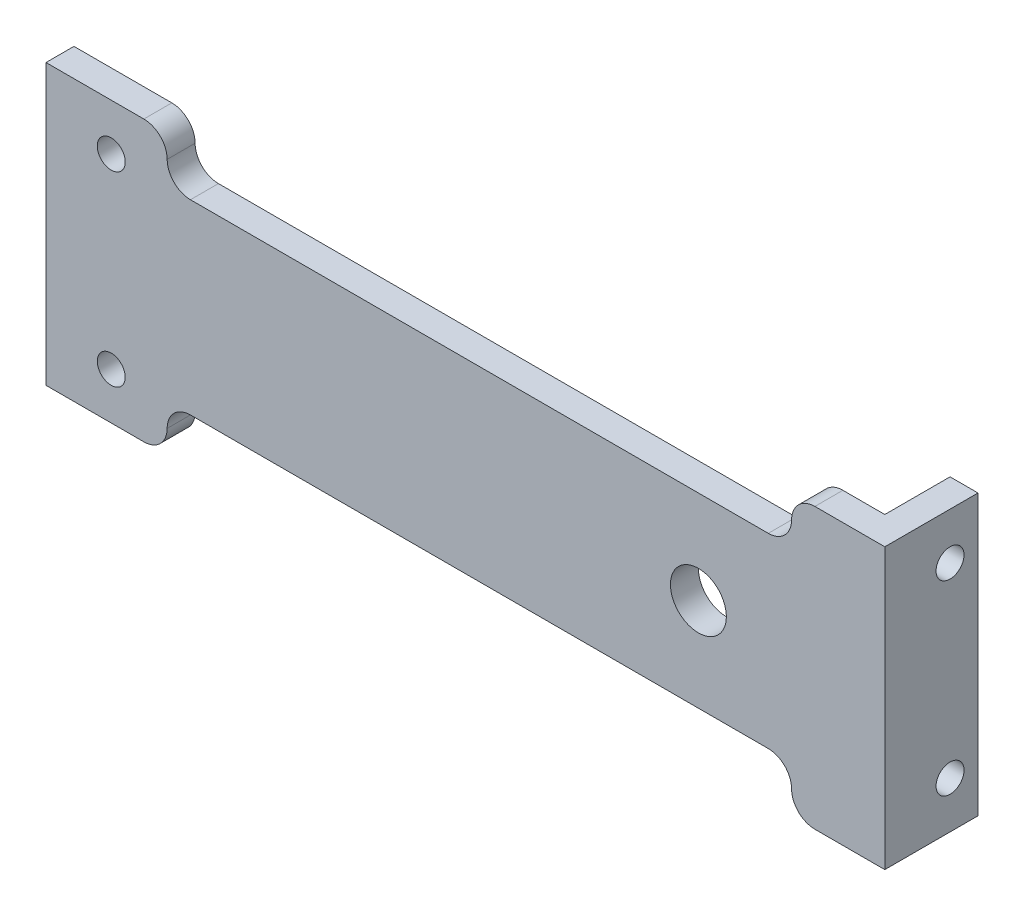
ISO-10303-21;
HEADER;
FILE_DESCRIPTION(('STEP AP214'),'2;1');
FILE_NAME('part.step','',(''),(''),'','','');
FILE_SCHEMA(('AUTOMOTIVE_DESIGN { 1 0 10303 214 1 1 1 1 }'));
ENDSEC;
DATA;
#1=APPLICATION_CONTEXT('core data for automotive mechanical design processes');
#2=APPLICATION_PROTOCOL_DEFINITION('international standard','automotive_design',2000,#1);
#3=PRODUCT_CONTEXT('',#1,'mechanical');
#4=PRODUCT('Part','Part','',(#3));
#5=PRODUCT_RELATED_PRODUCT_CATEGORY('part','',(#4));
#6=PRODUCT_DEFINITION_FORMATION('','',#4);
#7=PRODUCT_DEFINITION_CONTEXT('part definition',#1,'design');
#8=PRODUCT_DEFINITION('design','',#6,#7);
#9=PRODUCT_DEFINITION_SHAPE('','',#8);
#10=(LENGTH_UNIT() NAMED_UNIT(*) SI_UNIT(.MILLI.,.METRE.));
#11=(NAMED_UNIT(*) PLANE_ANGLE_UNIT() SI_UNIT($,.RADIAN.));
#12=(NAMED_UNIT(*) SI_UNIT($,.STERADIAN.) SOLID_ANGLE_UNIT());
#13=UNCERTAINTY_MEASURE_WITH_UNIT(LENGTH_MEASURE(1.E-05),#10,'distance_accuracy_value','');
#14=(GEOMETRIC_REPRESENTATION_CONTEXT(3) GLOBAL_UNCERTAINTY_ASSIGNED_CONTEXT((#13)) GLOBAL_UNIT_ASSIGNED_CONTEXT((#10,
#11,#12)) REPRESENTATION_CONTEXT('',''));
#15=CARTESIAN_POINT('',(0.,0.,0.));
#16=DIRECTION('',(0.,0.,1.));
#17=DIRECTION('',(1.,0.,0.));
#18=AXIS2_PLACEMENT_3D('',#15,#16,#17);
#19=CARTESIAN_POINT('',(0.,0.,0.));
#20=DIRECTION('',(0.,0.,1.));
#21=DIRECTION('',(1.,0.,0.));
#22=AXIS2_PLACEMENT_3D('',#19,#20,#21);
#23=PLANE('',#22);
#24=CARTESIAN_POINT('',(25.,0.,0.));
#25=DIRECTION('',(0.,0.,1.));
#26=DIRECTION('',(1.,0.,0.));
#27=AXIS2_PLACEMENT_3D('',#24,#25,#26);
#28=CIRCLE('',#27,3.);
#29=CARTESIAN_POINT('',(28.,0.,0.));
#30=VERTEX_POINT('',#29);
#31=EDGE_CURVE('E292',#30,#30,#28,.T.);
#32=ORIENTED_EDGE('',*,*,#31,.T.);
#33=EDGE_LOOP('',(#32));
#34=FACE_BOUND('',#33,.T.);
#35=CARTESIAN_POINT('',(-38.,10.,0.));
#36=DIRECTION('',(0.,0.,1.));
#37=DIRECTION('',(1.,0.,0.));
#38=AXIS2_PLACEMENT_3D('',#35,#36,#37);
#39=CIRCLE('',#38,1.5);
#40=CARTESIAN_POINT('',(-36.5,10.,0.));
#41=VERTEX_POINT('',#40);
#42=EDGE_CURVE('E203',#41,#41,#39,.T.);
#43=ORIENTED_EDGE('',*,*,#42,.T.);
#44=EDGE_LOOP('',(#43));
#45=FACE_BOUND('',#44,.T.);
#46=CARTESIAN_POINT('',(-38.,-10.,0.));
#47=DIRECTION('',(0.,0.,-1.));
#48=DIRECTION('',(1.,0.,0.));
#49=AXIS2_PLACEMENT_3D('',#46,#47,#48);
#50=CIRCLE('',#49,1.5);
#51=CARTESIAN_POINT('',(-36.5,-10.,0.));
#52=VERTEX_POINT('',#51);
#53=EDGE_CURVE('E315',#52,#52,#50,.T.);
#54=ORIENTED_EDGE('',*,*,#53,.F.);
#55=EDGE_LOOP('',(#54));
#56=FACE_BOUND('',#55,.T.);
#57=DIRECTION('',(1.,0.,0.));
#58=VECTOR('',#57,1.);
#59=CARTESIAN_POINT('',(-45.,-15.,0.));
#60=LINE('',#59,#58);
#61=CARTESIAN_POINT('',(37.5,-15.,0.));
#62=VERTEX_POINT('',#61);
#63=CARTESIAN_POINT('',(42.,-15.,0.));
#64=VERTEX_POINT('',#63);
#65=EDGE_CURVE('E225',#62,#64,#60,.T.);
#66=ORIENTED_EDGE('',*,*,#65,.F.);
#67=CARTESIAN_POINT('',(37.5,-12.5,0.));
#68=DIRECTION('',(0.,0.,1.));
#69=DIRECTION('',(1.,0.,0.));
#70=AXIS2_PLACEMENT_3D('',#67,#68,#69);
#71=CIRCLE('',#70,2.5);
#72=CARTESIAN_POINT('',(35.,-12.5,0.));
#73=VERTEX_POINT('',#72);
#74=EDGE_CURVE('E252',#62,#73,#71,.F.);
#75=ORIENTED_EDGE('',*,*,#74,.T.);
#76=CARTESIAN_POINT('',(32.5,-12.5,0.));
#77=DIRECTION('',(0.,0.,1.));
#78=DIRECTION('',(1.,0.,0.));
#79=AXIS2_PLACEMENT_3D('',#76,#77,#78);
#80=CIRCLE('',#79,2.5);
#81=CARTESIAN_POINT('',(32.5,-10.,0.));
#82=VERTEX_POINT('',#81);
#83=EDGE_CURVE('E50',#73,#82,#80,.T.);
#84=ORIENTED_EDGE('',*,*,#83,.T.);
#85=DIRECTION('',(1.,0.,0.));
#86=VECTOR('',#85,1.);
#87=CARTESIAN_POINT('',(0.,-10.,0.));
#88=LINE('',#87,#86);
#89=CARTESIAN_POINT('',(-29.5,-10.,0.));
#90=VERTEX_POINT('',#89);
#91=EDGE_CURVE('E306',#90,#82,#88,.T.);
#92=ORIENTED_EDGE('',*,*,#91,.F.);
#93=CARTESIAN_POINT('',(-29.5,-12.5,0.));
#94=DIRECTION('',(0.,0.,1.));
#95=DIRECTION('',(1.,0.,0.));
#96=AXIS2_PLACEMENT_3D('',#93,#94,#95);
#97=CIRCLE('',#96,2.5);
#98=CARTESIAN_POINT('',(-32.,-12.5,0.));
#99=VERTEX_POINT('',#98);
#100=EDGE_CURVE('E58',#90,#99,#97,.T.);
#101=ORIENTED_EDGE('',*,*,#100,.T.);
#102=CARTESIAN_POINT('',(-34.5,-12.5,0.));
#103=DIRECTION('',(0.,0.,1.));
#104=DIRECTION('',(1.,0.,0.));
#105=AXIS2_PLACEMENT_3D('',#102,#103,#104);
#106=CIRCLE('',#105,2.5);
#107=CARTESIAN_POINT('',(-34.5,-15.,0.));
#108=VERTEX_POINT('',#107);
#109=EDGE_CURVE('E250',#99,#108,#106,.F.);
#110=ORIENTED_EDGE('',*,*,#109,.T.);
#111=CARTESIAN_POINT('',(-45.,-15.,0.));
#112=VERTEX_POINT('',#111);
#113=EDGE_CURVE('E211',#112,#108,#60,.T.);
#114=ORIENTED_EDGE('',*,*,#113,.F.);
#115=DIRECTION('',(0.,-1.,0.));
#116=VECTOR('',#115,1.);
#117=CARTESIAN_POINT('',(-45.,15.,0.));
#118=LINE('',#117,#116);
#119=CARTESIAN_POINT('',(-45.,15.,0.));
#120=VERTEX_POINT('',#119);
#121=EDGE_CURVE('E223',#120,#112,#118,.T.);
#122=ORIENTED_EDGE('',*,*,#121,.F.);
#123=DIRECTION('',(-1.,0.,0.));
#124=VECTOR('',#123,1.);
#125=CARTESIAN_POINT('',(-45.,15.,0.));
#126=LINE('',#125,#124);
#127=CARTESIAN_POINT('',(-34.5,15.,0.));
#128=VERTEX_POINT('',#127);
#129=EDGE_CURVE('E206',#128,#120,#126,.T.);
#130=ORIENTED_EDGE('',*,*,#129,.F.);
#131=CARTESIAN_POINT('',(-34.5,12.5,0.));
#132=DIRECTION('',(0.,0.,1.));
#133=DIRECTION('',(1.,0.,0.));
#134=AXIS2_PLACEMENT_3D('',#131,#132,#133);
#135=CIRCLE('',#134,2.5);
#136=CARTESIAN_POINT('',(-32.,12.5,0.));
#137=VERTEX_POINT('',#136);
#138=EDGE_CURVE('E246',#128,#137,#135,.F.);
#139=ORIENTED_EDGE('',*,*,#138,.T.);
#140=CARTESIAN_POINT('',(-29.5,12.5,0.));
#141=DIRECTION('',(0.,0.,1.));
#142=DIRECTION('',(1.,0.,0.));
#143=AXIS2_PLACEMENT_3D('',#140,#141,#142);
#144=CIRCLE('',#143,2.5);
#145=CARTESIAN_POINT('',(-29.5,10.,0.));
#146=VERTEX_POINT('',#145);
#147=EDGE_CURVE('E11',#137,#146,#144,.T.);
#148=ORIENTED_EDGE('',*,*,#147,.T.);
#149=DIRECTION('',(1.,0.,0.));
#150=VECTOR('',#149,1.);
#151=CARTESIAN_POINT('',(0.,10.,0.));
#152=LINE('',#151,#150);
#153=CARTESIAN_POINT('',(32.5,10.,0.));
#154=VERTEX_POINT('',#153);
#155=EDGE_CURVE('E323',#146,#154,#152,.T.);
#156=ORIENTED_EDGE('',*,*,#155,.T.);
#157=CARTESIAN_POINT('',(32.5,12.5,0.));
#158=DIRECTION('',(0.,0.,1.));
#159=DIRECTION('',(1.,0.,0.));
#160=AXIS2_PLACEMENT_3D('',#157,#158,#159);
#161=CIRCLE('',#160,2.5);
#162=CARTESIAN_POINT('',(35.,12.5,0.));
#163=VERTEX_POINT('',#162);
#164=EDGE_CURVE('E278',#154,#163,#161,.T.);
#165=ORIENTED_EDGE('',*,*,#164,.T.);
#166=CARTESIAN_POINT('',(37.5,12.5,0.));
#167=DIRECTION('',(0.,0.,1.));
#168=DIRECTION('',(1.,0.,0.));
#169=AXIS2_PLACEMENT_3D('',#166,#167,#168);
#170=CIRCLE('',#169,2.5);
#171=CARTESIAN_POINT('',(37.5,15.,0.));
#172=VERTEX_POINT('',#171);
#173=EDGE_CURVE('E248',#163,#172,#170,.F.);
#174=ORIENTED_EDGE('',*,*,#173,.T.);
#175=CARTESIAN_POINT('',(42.,15.,0.));
#176=VERTEX_POINT('',#175);
#177=EDGE_CURVE('E220',#176,#172,#126,.T.);
#178=ORIENTED_EDGE('',*,*,#177,.F.);
#179=DIRECTION('',(0.,1.,0.));
#180=VECTOR('',#179,1.);
#181=CARTESIAN_POINT('',(42.,15.,0.));
#182=LINE('',#181,#180);
#183=EDGE_CURVE('E188',#64,#176,#182,.T.);
#184=ORIENTED_EDGE('',*,*,#183,.F.);
#185=EDGE_LOOP('',(#66,#75,#84,#92,#101,#110,#114,#122,#130,#139,#148,#156,#165,#174,#178,#184));
#186=FACE_BOUND('',#185,.T.);
#187=ADVANCED_FACE('F33',(#34,#45,#56,#186),#23,.F.);
#188=CARTESIAN_POINT('',(-45.,-15.,3.));
#189=DIRECTION('',(0.,1.,0.));
#190=DIRECTION('',(0.,0.,1.));
#191=AXIS2_PLACEMENT_3D('',#188,#189,#190);
#192=PLANE('',#191);
#193=ORIENTED_EDGE('',*,*,#113,.T.);
#194=DIRECTION('',(0.,0.,1.));
#195=VECTOR('',#194,1.);
#196=CARTESIAN_POINT('',(-34.5,-15.,3.));
#197=LINE('',#196,#195);
#198=CARTESIAN_POINT('',(-34.5,-15.,3.));
#199=VERTEX_POINT('',#198);
#200=EDGE_CURVE('E258',#108,#199,#197,.T.);
#201=ORIENTED_EDGE('',*,*,#200,.T.);
#202=DIRECTION('',(1.,0.,0.));
#203=VECTOR('',#202,1.);
#204=CARTESIAN_POINT('',(-45.,-15.,3.));
#205=LINE('',#204,#203);
#206=CARTESIAN_POINT('',(-45.,-15.,3.));
#207=VERTEX_POINT('',#206);
#208=EDGE_CURVE('E173',#207,#199,#205,.T.);
#209=ORIENTED_EDGE('',*,*,#208,.F.);
#210=DIRECTION('',(0.,0.,-1.));
#211=VECTOR('',#210,1.);
#212=CARTESIAN_POINT('',(-45.,-15.,3.));
#213=LINE('',#212,#211);
#214=EDGE_CURVE('E172',#207,#112,#213,.T.);
#215=ORIENTED_EDGE('',*,*,#214,.T.);
#216=EDGE_LOOP('',(#193,#201,#209,#215));
#217=FACE_BOUND('',#216,.T.);
#218=ADVANCED_FACE('F347',(#217),#192,.F.);
#219=CARTESIAN_POINT('',(37.5,-15.,3.));
#220=VERTEX_POINT('',#219);
#221=CARTESIAN_POINT('',(45.,-15.,3.));
#222=VERTEX_POINT('',#221);
#223=EDGE_CURVE('E217',#220,#222,#205,.T.);
#224=ORIENTED_EDGE('',*,*,#223,.F.);
#225=DIRECTION('',(0.,0.,1.));
#226=VECTOR('',#225,1.);
#227=CARTESIAN_POINT('',(37.5,-15.,0.));
#228=LINE('',#227,#226);
#229=EDGE_CURVE('E243',#220,#62,#228,.F.);
#230=ORIENTED_EDGE('',*,*,#229,.T.);
#231=ORIENTED_EDGE('',*,*,#65,.T.);
#232=DIRECTION('',(0.,0.,1.));
#233=VECTOR('',#232,1.);
#234=CARTESIAN_POINT('',(42.,-15.,-7.));
#235=LINE('',#234,#233);
#236=CARTESIAN_POINT('',(42.,-15.,-7.));
#237=VERTEX_POINT('',#236);
#238=EDGE_CURVE('E179',#237,#64,#235,.T.);
#239=ORIENTED_EDGE('',*,*,#238,.F.);
#240=DIRECTION('',(-1.,0.,0.));
#241=VECTOR('',#240,1.);
#242=CARTESIAN_POINT('',(45.,-15.,-7.));
#243=LINE('',#242,#241);
#244=CARTESIAN_POINT('',(45.,-15.,-7.));
#245=VERTEX_POINT('',#244);
#246=EDGE_CURVE('E176',#245,#237,#243,.T.);
#247=ORIENTED_EDGE('',*,*,#246,.F.);
#248=DIRECTION('',(0.,0.,-1.));
#249=VECTOR('',#248,1.);
#250=CARTESIAN_POINT('',(45.,-15.,3.));
#251=LINE('',#250,#249);
#252=EDGE_CURVE('E162',#222,#245,#251,.T.);
#253=ORIENTED_EDGE('',*,*,#252,.F.);
#254=EDGE_LOOP('',(#224,#230,#231,#239,#247,#253));
#255=FACE_BOUND('',#254,.T.);
#256=ADVANCED_FACE('F177',(#255),#192,.F.);
#257=CARTESIAN_POINT('',(0.,0.,3.));
#258=DIRECTION('',(0.,0.,1.));
#259=DIRECTION('',(1.,0.,0.));
#260=AXIS2_PLACEMENT_3D('',#257,#258,#259);
#261=PLANE('',#260);
#262=CARTESIAN_POINT('',(25.,0.,3.));
#263=DIRECTION('',(0.,0.,1.));
#264=DIRECTION('',(1.,0.,0.));
#265=AXIS2_PLACEMENT_3D('',#262,#263,#264);
#266=CIRCLE('',#265,3.);
#267=CARTESIAN_POINT('',(28.,0.,3.));
#268=VERTEX_POINT('',#267);
#269=EDGE_CURVE('E297',#268,#268,#266,.T.);
#270=ORIENTED_EDGE('',*,*,#269,.F.);
#271=EDGE_LOOP('',(#270));
#272=FACE_BOUND('',#271,.T.);
#273=CARTESIAN_POINT('',(-38.,-10.,3.));
#274=DIRECTION('',(0.,0.,-1.));
#275=DIRECTION('',(1.,0.,0.));
#276=AXIS2_PLACEMENT_3D('',#273,#274,#275);
#277=CIRCLE('',#276,1.5);
#278=CARTESIAN_POINT('',(-36.5,-10.,3.));
#279=VERTEX_POINT('',#278);
#280=EDGE_CURVE('E314',#279,#279,#277,.T.);
#281=ORIENTED_EDGE('',*,*,#280,.T.);
#282=EDGE_LOOP('',(#281));
#283=FACE_BOUND('',#282,.T.);
#284=CARTESIAN_POINT('',(-38.,10.,3.));
#285=DIRECTION('',(0.,0.,1.));
#286=DIRECTION('',(1.,0.,0.));
#287=AXIS2_PLACEMENT_3D('',#284,#285,#286);
#288=CIRCLE('',#287,1.5);
#289=CARTESIAN_POINT('',(-36.5,10.,3.));
#290=VERTEX_POINT('',#289);
#291=EDGE_CURVE('E202',#290,#290,#288,.T.);
#292=ORIENTED_EDGE('',*,*,#291,.F.);
#293=EDGE_LOOP('',(#292));
#294=FACE_BOUND('',#293,.T.);
#295=DIRECTION('',(1.,0.,0.));
#296=VECTOR('',#295,1.);
#297=CARTESIAN_POINT('',(-32.,-10.,3.));
#298=LINE('',#297,#296);
#299=CARTESIAN_POINT('',(-29.5,-10.,3.));
#300=VERTEX_POINT('',#299);
#301=CARTESIAN_POINT('',(32.5,-10.,3.));
#302=VERTEX_POINT('',#301);
#303=EDGE_CURVE('E284',#300,#302,#298,.T.);
#304=ORIENTED_EDGE('',*,*,#303,.T.);
#305=CARTESIAN_POINT('',(32.5,-12.5,3.));
#306=DIRECTION('',(0.,0.,1.));
#307=DIRECTION('',(1.,0.,0.));
#308=AXIS2_PLACEMENT_3D('',#305,#306,#307);
#309=CIRCLE('',#308,2.5);
#310=CARTESIAN_POINT('',(35.,-12.5,3.));
#311=VERTEX_POINT('',#310);
#312=EDGE_CURVE('E270',#302,#311,#309,.F.);
#313=ORIENTED_EDGE('',*,*,#312,.T.);
#314=CARTESIAN_POINT('',(37.5,-12.5,3.));
#315=DIRECTION('',(0.,0.,1.));
#316=DIRECTION('',(1.,0.,0.));
#317=AXIS2_PLACEMENT_3D('',#314,#315,#316);
#318=CIRCLE('',#317,2.5);
#319=EDGE_CURVE('E241',#311,#220,#318,.T.);
#320=ORIENTED_EDGE('',*,*,#319,.T.);
#321=ORIENTED_EDGE('',*,*,#223,.T.);
#322=DIRECTION('',(0.,1.,0.));
#323=VECTOR('',#322,1.);
#324=CARTESIAN_POINT('',(45.,15.,3.));
#325=LINE('',#324,#323);
#326=CARTESIAN_POINT('',(45.,15.,3.));
#327=VERTEX_POINT('',#326);
#328=EDGE_CURVE('E169',#222,#327,#325,.T.);
#329=ORIENTED_EDGE('',*,*,#328,.T.);
#330=DIRECTION('',(-1.,0.,0.));
#331=VECTOR('',#330,1.);
#332=CARTESIAN_POINT('',(-45.,15.,3.));
#333=LINE('',#332,#331);
#334=CARTESIAN_POINT('',(37.5,15.,3.));
#335=VERTEX_POINT('',#334);
#336=EDGE_CURVE('E212',#327,#335,#333,.T.);
#337=ORIENTED_EDGE('',*,*,#336,.T.);
#338=CARTESIAN_POINT('',(37.5,12.5,3.));
#339=DIRECTION('',(0.,0.,1.));
#340=DIRECTION('',(1.,0.,0.));
#341=AXIS2_PLACEMENT_3D('',#338,#339,#340);
#342=CIRCLE('',#341,2.5);
#343=CARTESIAN_POINT('',(35.,12.5,3.));
#344=VERTEX_POINT('',#343);
#345=EDGE_CURVE('E237',#335,#344,#342,.T.);
#346=ORIENTED_EDGE('',*,*,#345,.T.);
#347=CARTESIAN_POINT('',(32.5,12.5,3.));
#348=DIRECTION('',(0.,0.,1.));
#349=DIRECTION('',(1.,0.,0.));
#350=AXIS2_PLACEMENT_3D('',#347,#348,#349);
#351=CIRCLE('',#350,2.5);
#352=CARTESIAN_POINT('',(32.5,10.,3.));
#353=VERTEX_POINT('',#352);
#354=EDGE_CURVE('E276',#344,#353,#351,.F.);
#355=ORIENTED_EDGE('',*,*,#354,.T.);
#356=DIRECTION('',(1.,0.,0.));
#357=VECTOR('',#356,1.);
#358=CARTESIAN_POINT('',(-32.,10.,3.));
#359=LINE('',#358,#357);
#360=CARTESIAN_POINT('',(-29.5,10.,3.));
#361=VERTEX_POINT('',#360);
#362=EDGE_CURVE('E318',#361,#353,#359,.T.);
#363=ORIENTED_EDGE('',*,*,#362,.F.);
#364=CARTESIAN_POINT('',(-29.5,12.5,3.));
#365=DIRECTION('',(0.,0.,1.));
#366=DIRECTION('',(1.,0.,0.));
#367=AXIS2_PLACEMENT_3D('',#364,#365,#366);
#368=CIRCLE('',#367,2.5);
#369=CARTESIAN_POINT('',(-32.,12.5,3.));
#370=VERTEX_POINT('',#369);
#371=EDGE_CURVE('E42',#361,#370,#368,.F.);
#372=ORIENTED_EDGE('',*,*,#371,.T.);
#373=CARTESIAN_POINT('',(-34.5,12.5,3.));
#374=DIRECTION('',(0.,0.,1.));
#375=DIRECTION('',(1.,0.,0.));
#376=AXIS2_PLACEMENT_3D('',#373,#374,#375);
#377=CIRCLE('',#376,2.5);
#378=CARTESIAN_POINT('',(-34.5,15.,3.));
#379=VERTEX_POINT('',#378);
#380=EDGE_CURVE('E235',#370,#379,#377,.T.);
#381=ORIENTED_EDGE('',*,*,#380,.T.);
#382=CARTESIAN_POINT('',(-45.,15.,3.));
#383=VERTEX_POINT('',#382);
#384=EDGE_CURVE('E210',#379,#383,#333,.T.);
#385=ORIENTED_EDGE('',*,*,#384,.T.);
#386=DIRECTION('',(0.,-1.,0.));
#387=VECTOR('',#386,1.);
#388=CARTESIAN_POINT('',(-45.,15.,3.));
#389=LINE('',#388,#387);
#390=EDGE_CURVE('E215',#383,#207,#389,.T.);
#391=ORIENTED_EDGE('',*,*,#390,.T.);
#392=ORIENTED_EDGE('',*,*,#208,.T.);
#393=CARTESIAN_POINT('',(-34.5,-12.5,3.));
#394=DIRECTION('',(0.,0.,1.));
#395=DIRECTION('',(1.,0.,0.));
#396=AXIS2_PLACEMENT_3D('',#393,#394,#395);
#397=CIRCLE('',#396,2.5);
#398=CARTESIAN_POINT('',(-32.,-12.5,3.));
#399=VERTEX_POINT('',#398);
#400=EDGE_CURVE('E239',#199,#399,#397,.T.);
#401=ORIENTED_EDGE('',*,*,#400,.T.);
#402=CARTESIAN_POINT('',(-29.5,-12.5,3.));
#403=DIRECTION('',(0.,0.,1.));
#404=DIRECTION('',(1.,0.,0.));
#405=AXIS2_PLACEMENT_3D('',#402,#403,#404);
#406=CIRCLE('',#405,2.5);
#407=EDGE_CURVE('E273',#399,#300,#406,.F.);
#408=ORIENTED_EDGE('',*,*,#407,.T.);
#409=EDGE_LOOP('',(#304,#313,#320,#321,#329,#337,#346,#355,#363,#372,#381,#385,#391,#392,#401,#408));
#410=FACE_BOUND('',#409,.T.);
#411=ADVANCED_FACE('F356',(#272,#283,#294,#410),#261,.T.);
#412=CARTESIAN_POINT('',(-45.,15.,3.));
#413=DIRECTION('',(0.,-1.,0.));
#414=DIRECTION('',(0.,0.,-1.));
#415=AXIS2_PLACEMENT_3D('',#412,#413,#414);
#416=PLANE('',#415);
#417=ORIENTED_EDGE('',*,*,#384,.F.);
#418=DIRECTION('',(0.,0.,1.));
#419=VECTOR('',#418,1.);
#420=CARTESIAN_POINT('',(-34.5,15.,3.));
#421=LINE('',#420,#419);
#422=EDGE_CURVE('E268',#379,#128,#421,.F.);
#423=ORIENTED_EDGE('',*,*,#422,.T.);
#424=ORIENTED_EDGE('',*,*,#129,.T.);
#425=DIRECTION('',(0.,0.,-1.));
#426=VECTOR('',#425,1.);
#427=CARTESIAN_POINT('',(-45.,15.,3.));
#428=LINE('',#427,#426);
#429=EDGE_CURVE('E230',#383,#120,#428,.T.);
#430=ORIENTED_EDGE('',*,*,#429,.F.);
#431=EDGE_LOOP('',(#417,#423,#424,#430));
#432=FACE_BOUND('',#431,.T.);
#433=ADVANCED_FACE('F368',(#432),#416,.F.);
#434=CARTESIAN_POINT('',(45.,15.,3.));
#435=DIRECTION('',(-1.,0.,0.));
#436=DIRECTION('',(0.,0.,1.));
#437=AXIS2_PLACEMENT_3D('',#434,#435,#436);
#438=PLANE('',#437);
#439=CARTESIAN_POINT('',(45.,-9.99999999999999,-4.));
#440=DIRECTION('',(-1.,0.,0.));
#441=DIRECTION('',(0.,0.,1.));
#442=AXIS2_PLACEMENT_3D('',#439,#440,#441);
#443=CIRCLE('',#442,1.5);
#444=CARTESIAN_POINT('',(45.,-9.99999999999999,-2.5));
#445=VERTEX_POINT('',#444);
#446=EDGE_CURVE('E311',#445,#445,#443,.F.);
#447=ORIENTED_EDGE('',*,*,#446,.F.);
#448=EDGE_LOOP('',(#447));
#449=FACE_BOUND('',#448,.T.);
#450=CARTESIAN_POINT('',(45.,9.99999999999999,-4.));
#451=DIRECTION('',(-1.,0.,0.));
#452=DIRECTION('',(0.,0.,1.));
#453=AXIS2_PLACEMENT_3D('',#450,#451,#452);
#454=CIRCLE('',#453,1.5);
#455=CARTESIAN_POINT('',(45.,9.99999999999999,-2.5));
#456=VERTEX_POINT('',#455);
#457=EDGE_CURVE('E191',#456,#456,#454,.T.);
#458=ORIENTED_EDGE('',*,*,#457,.T.);
#459=EDGE_LOOP('',(#458));
#460=FACE_BOUND('',#459,.T.);
#461=ORIENTED_EDGE('',*,*,#252,.T.);
#462=DIRECTION('',(0.,-1.,0.));
#463=VECTOR('',#462,1.);
#464=CARTESIAN_POINT('',(45.,15.,-7.));
#465=LINE('',#464,#463);
#466=CARTESIAN_POINT('',(45.,15.,-7.));
#467=VERTEX_POINT('',#466);
#468=EDGE_CURVE('E167',#467,#245,#465,.T.);
#469=ORIENTED_EDGE('',*,*,#468,.F.);
#470=DIRECTION('',(0.,0.,-1.));
#471=VECTOR('',#470,1.);
#472=CARTESIAN_POINT('',(45.,15.,3.));
#473=LINE('',#472,#471);
#474=EDGE_CURVE('E233',#327,#467,#473,.T.);
#475=ORIENTED_EDGE('',*,*,#474,.F.);
#476=ORIENTED_EDGE('',*,*,#328,.F.);
#477=EDGE_LOOP('',(#461,#469,#475,#476));
#478=FACE_BOUND('',#477,.T.);
#479=ADVANCED_FACE('F164',(#449,#460,#478),#438,.F.);
#480=ORIENTED_EDGE('',*,*,#177,.T.);
#481=DIRECTION('',(0.,0.,1.));
#482=VECTOR('',#481,1.);
#483=CARTESIAN_POINT('',(37.5,15.,3.));
#484=LINE('',#483,#482);
#485=EDGE_CURVE('E266',#172,#335,#484,.T.);
#486=ORIENTED_EDGE('',*,*,#485,.T.);
#487=ORIENTED_EDGE('',*,*,#336,.F.);
#488=ORIENTED_EDGE('',*,*,#474,.T.);
#489=DIRECTION('',(1.,0.,0.));
#490=VECTOR('',#489,1.);
#491=CARTESIAN_POINT('',(45.,15.,-7.));
#492=LINE('',#491,#490);
#493=CARTESIAN_POINT('',(42.,15.,-7.));
#494=VERTEX_POINT('',#493);
#495=EDGE_CURVE('E187',#494,#467,#492,.T.);
#496=ORIENTED_EDGE('',*,*,#495,.F.);
#497=DIRECTION('',(0.,0.,1.));
#498=VECTOR('',#497,1.);
#499=CARTESIAN_POINT('',(42.,15.,-7.));
#500=LINE('',#499,#498);
#501=EDGE_CURVE('E197',#494,#176,#500,.T.);
#502=ORIENTED_EDGE('',*,*,#501,.T.);
#503=EDGE_LOOP('',(#480,#486,#487,#488,#496,#502));
#504=FACE_BOUND('',#503,.T.);
#505=ADVANCED_FACE('F363',(#504),#416,.F.);
#506=CARTESIAN_POINT('',(-45.,15.,3.));
#507=DIRECTION('',(1.,0.,0.));
#508=DIRECTION('',(0.,1.,0.));
#509=AXIS2_PLACEMENT_3D('',#506,#507,#508);
#510=PLANE('',#509);
#511=ORIENTED_EDGE('',*,*,#121,.T.);
#512=ORIENTED_EDGE('',*,*,#214,.F.);
#513=ORIENTED_EDGE('',*,*,#390,.F.);
#514=ORIENTED_EDGE('',*,*,#429,.T.);
#515=EDGE_LOOP('',(#511,#512,#513,#514));
#516=FACE_BOUND('',#515,.T.);
#517=ADVANCED_FACE('F359',(#516),#510,.F.);
#518=CARTESIAN_POINT('',(-38.,10.,0.));
#519=DIRECTION('',(0.,0.,1.));
#520=DIRECTION('',(1.,0.,0.));
#521=AXIS2_PLACEMENT_3D('',#518,#519,#520);
#522=CYLINDRICAL_SURFACE('',#521,1.5);
#523=ORIENTED_EDGE('',*,*,#42,.F.);
#524=EDGE_LOOP('',(#523));
#525=FACE_BOUND('',#524,.T.);
#526=ORIENTED_EDGE('',*,*,#291,.T.);
#527=EDGE_LOOP('',(#526));
#528=FACE_BOUND('',#527,.T.);
#529=ADVANCED_FACE('F362',(#525,#528),#522,.F.);
#530=CARTESIAN_POINT('',(42.,15.,-7.));
#531=DIRECTION('',(1.,0.,0.));
#532=DIRECTION('',(0.,0.,-1.));
#533=AXIS2_PLACEMENT_3D('',#530,#531,#532);
#534=PLANE('',#533);
#535=CARTESIAN_POINT('',(42.,-9.99999999999999,-4.));
#536=DIRECTION('',(1.,0.,0.));
#537=DIRECTION('',(0.,0.,1.));
#538=AXIS2_PLACEMENT_3D('',#535,#536,#537);
#539=CIRCLE('',#538,1.5);
#540=CARTESIAN_POINT('',(42.,-9.99999999999999,-2.5));
#541=VERTEX_POINT('',#540);
#542=EDGE_CURVE('E308',#541,#541,#539,.T.);
#543=ORIENTED_EDGE('',*,*,#542,.T.);
#544=EDGE_LOOP('',(#543));
#545=FACE_BOUND('',#544,.T.);
#546=CARTESIAN_POINT('',(42.,9.99999999999999,-4.));
#547=DIRECTION('',(-1.,0.,0.));
#548=DIRECTION('',(0.,0.,1.));
#549=AXIS2_PLACEMENT_3D('',#546,#547,#548);
#550=CIRCLE('',#549,1.5);
#551=CARTESIAN_POINT('',(42.,9.99999999999999,-2.5));
#552=VERTEX_POINT('',#551);
#553=EDGE_CURVE('E325',#552,#552,#550,.T.);
#554=ORIENTED_EDGE('',*,*,#553,.F.);
#555=EDGE_LOOP('',(#554));
#556=FACE_BOUND('',#555,.T.);
#557=ORIENTED_EDGE('',*,*,#183,.T.);
#558=ORIENTED_EDGE('',*,*,#501,.F.);
#559=DIRECTION('',(0.,1.,0.));
#560=VECTOR('',#559,1.);
#561=CARTESIAN_POINT('',(42.,15.,-7.));
#562=LINE('',#561,#560);
#563=EDGE_CURVE('E182',#237,#494,#562,.T.);
#564=ORIENTED_EDGE('',*,*,#563,.F.);
#565=ORIENTED_EDGE('',*,*,#238,.T.);
#566=EDGE_LOOP('',(#557,#558,#564,#565));
#567=FACE_BOUND('',#566,.T.);
#568=ADVANCED_FACE('F344',(#545,#556,#567),#534,.F.);
#569=CARTESIAN_POINT('',(0.,0.,-7.));
#570=DIRECTION('',(0.,0.,-1.));
#571=DIRECTION('',(-1.,0.,0.));
#572=AXIS2_PLACEMENT_3D('',#569,#570,#571);
#573=PLANE('',#572);
#574=ORIENTED_EDGE('',*,*,#468,.T.);
#575=ORIENTED_EDGE('',*,*,#246,.T.);
#576=ORIENTED_EDGE('',*,*,#563,.T.);
#577=ORIENTED_EDGE('',*,*,#495,.T.);
#578=EDGE_LOOP('',(#574,#575,#576,#577));
#579=FACE_BOUND('',#578,.T.);
#580=ADVANCED_FACE('F185',(#579),#573,.T.);
#581=CARTESIAN_POINT('',(49.,9.99999999999999,-4.));
#582=DIRECTION('',(-1.,0.,0.));
#583=DIRECTION('',(0.,0.,1.));
#584=AXIS2_PLACEMENT_3D('',#581,#582,#583);
#585=CYLINDRICAL_SURFACE('',#584,1.5);
#586=ORIENTED_EDGE('',*,*,#553,.T.);
#587=EDGE_LOOP('',(#586));
#588=FACE_BOUND('',#587,.T.);
#589=ORIENTED_EDGE('',*,*,#457,.F.);
#590=EDGE_LOOP('',(#589));
#591=FACE_BOUND('',#590,.T.);
#592=ADVANCED_FACE('F333',(#588,#591),#585,.F.);
#593=CARTESIAN_POINT('',(-32.,10.,-4.));
#594=DIRECTION('',(0.,-1.,0.));
#595=DIRECTION('',(0.,0.,-1.));
#596=AXIS2_PLACEMENT_3D('',#593,#594,#595);
#597=PLANE('',#596);
#598=ORIENTED_EDGE('',*,*,#362,.T.);
#599=DIRECTION('',(0.,0.,1.));
#600=VECTOR('',#599,1.);
#601=CARTESIAN_POINT('',(32.5,10.,0.));
#602=LINE('',#601,#600);
#603=EDGE_CURVE('E263',#353,#154,#602,.F.);
#604=ORIENTED_EDGE('',*,*,#603,.T.);
#605=ORIENTED_EDGE('',*,*,#155,.F.);
#606=DIRECTION('',(0.,0.,1.));
#607=VECTOR('',#606,1.);
#608=CARTESIAN_POINT('',(-29.5,10.,3.));
#609=LINE('',#608,#607);
#610=EDGE_CURVE('E260',#146,#361,#609,.T.);
#611=ORIENTED_EDGE('',*,*,#610,.T.);
#612=EDGE_LOOP('',(#598,#604,#605,#611));
#613=FACE_BOUND('',#612,.T.);
#614=ADVANCED_FACE('F335',(#613),#597,.F.);
#615=CARTESIAN_POINT('',(-38.,-10.,0.));
#616=DIRECTION('',(0.,0.,1.));
#617=DIRECTION('',(1.,0.,0.));
#618=AXIS2_PLACEMENT_3D('',#615,#616,#617);
#619=CYLINDRICAL_SURFACE('',#618,1.5);
#620=ORIENTED_EDGE('',*,*,#53,.T.);
#621=EDGE_LOOP('',(#620));
#622=FACE_BOUND('',#621,.T.);
#623=ORIENTED_EDGE('',*,*,#280,.F.);
#624=EDGE_LOOP('',(#623));
#625=FACE_BOUND('',#624,.T.);
#626=ADVANCED_FACE('F341',(#622,#625),#619,.F.);
#627=CARTESIAN_POINT('',(49.,-9.99999999999999,-4.));
#628=DIRECTION('',(-1.,0.,0.));
#629=DIRECTION('',(0.,0.,1.));
#630=AXIS2_PLACEMENT_3D('',#627,#628,#629);
#631=CYLINDRICAL_SURFACE('',#630,1.5);
#632=ORIENTED_EDGE('',*,*,#542,.F.);
#633=EDGE_LOOP('',(#632));
#634=FACE_BOUND('',#633,.T.);
#635=ORIENTED_EDGE('',*,*,#446,.T.);
#636=EDGE_LOOP('',(#635));
#637=FACE_BOUND('',#636,.T.);
#638=ADVANCED_FACE('F467',(#634,#637),#631,.F.);
#639=CARTESIAN_POINT('',(-32.,-10.,-4.));
#640=DIRECTION('',(0.,-1.,0.));
#641=DIRECTION('',(0.,0.,-1.));
#642=AXIS2_PLACEMENT_3D('',#639,#640,#641);
#643=PLANE('',#642);
#644=ORIENTED_EDGE('',*,*,#91,.T.);
#645=DIRECTION('',(0.,0.,1.));
#646=VECTOR('',#645,1.);
#647=CARTESIAN_POINT('',(32.5,-10.,3.));
#648=LINE('',#647,#646);
#649=EDGE_CURVE('E256',#82,#302,#648,.T.);
#650=ORIENTED_EDGE('',*,*,#649,.T.);
#651=ORIENTED_EDGE('',*,*,#303,.F.);
#652=DIRECTION('',(0.,0.,1.));
#653=VECTOR('',#652,1.);
#654=CARTESIAN_POINT('',(-29.5,-10.,0.));
#655=LINE('',#654,#653);
#656=EDGE_CURVE('E254',#300,#90,#655,.F.);
#657=ORIENTED_EDGE('',*,*,#656,.T.);
#658=EDGE_LOOP('',(#644,#650,#651,#657));
#659=FACE_BOUND('',#658,.T.);
#660=ADVANCED_FACE('F380',(#659),#643,.T.);
#661=CARTESIAN_POINT('',(32.5,-12.5,-4.));
#662=DIRECTION('',(0.,0.,-1.));
#663=DIRECTION('',(-1.,0.,0.));
#664=AXIS2_PLACEMENT_3D('',#661,#662,#663);
#665=CYLINDRICAL_SURFACE('',#664,2.5);
#666=ORIENTED_EDGE('',*,*,#649,.F.);
#667=ORIENTED_EDGE('',*,*,#83,.F.);
#668=DIRECTION('',(0.,0.,1.));
#669=VECTOR('',#668,1.);
#670=CARTESIAN_POINT('',(35.,-12.5,0.));
#671=LINE('',#670,#669);
#672=EDGE_CURVE('E281',#311,#73,#671,.F.);
#673=ORIENTED_EDGE('',*,*,#672,.F.);
#674=ORIENTED_EDGE('',*,*,#312,.F.);
#675=EDGE_LOOP('',(#666,#667,#673,#674));
#676=FACE_BOUND('',#675,.T.);
#677=ADVANCED_FACE('F376',(#676),#665,.F.);
#678=CARTESIAN_POINT('',(37.5,-12.5,-4.));
#679=DIRECTION('',(0.,0.,-1.));
#680=DIRECTION('',(-1.,0.,0.));
#681=AXIS2_PLACEMENT_3D('',#678,#679,#680);
#682=CYLINDRICAL_SURFACE('',#681,2.5);
#683=ORIENTED_EDGE('',*,*,#74,.F.);
#684=ORIENTED_EDGE('',*,*,#229,.F.);
#685=ORIENTED_EDGE('',*,*,#319,.F.);
#686=ORIENTED_EDGE('',*,*,#672,.T.);
#687=EDGE_LOOP('',(#683,#684,#685,#686));
#688=FACE_BOUND('',#687,.T.);
#689=ADVANCED_FACE('F372',(#688),#682,.T.);
#690=CARTESIAN_POINT('',(-34.5,-12.5,3.));
#691=DIRECTION('',(0.,0.,-1.));
#692=DIRECTION('',(-1.,0.,0.));
#693=AXIS2_PLACEMENT_3D('',#690,#691,#692);
#694=CYLINDRICAL_SURFACE('',#693,2.5);
#695=ORIENTED_EDGE('',*,*,#200,.F.);
#696=ORIENTED_EDGE('',*,*,#109,.F.);
#697=DIRECTION('',(0.,0.,1.));
#698=VECTOR('',#697,1.);
#699=CARTESIAN_POINT('',(-32.,-12.5,0.));
#700=LINE('',#699,#698);
#701=EDGE_CURVE('E285',#399,#99,#700,.F.);
#702=ORIENTED_EDGE('',*,*,#701,.F.);
#703=ORIENTED_EDGE('',*,*,#400,.F.);
#704=EDGE_LOOP('',(#695,#696,#702,#703));
#705=FACE_BOUND('',#704,.T.);
#706=ADVANCED_FACE('F375',(#705),#694,.T.);
#707=CARTESIAN_POINT('',(-29.5,-12.5,-4.));
#708=DIRECTION('',(0.,0.,-1.));
#709=DIRECTION('',(-1.,0.,0.));
#710=AXIS2_PLACEMENT_3D('',#707,#708,#709);
#711=CYLINDRICAL_SURFACE('',#710,2.5);
#712=ORIENTED_EDGE('',*,*,#100,.F.);
#713=ORIENTED_EDGE('',*,*,#656,.F.);
#714=ORIENTED_EDGE('',*,*,#407,.F.);
#715=ORIENTED_EDGE('',*,*,#701,.T.);
#716=EDGE_LOOP('',(#712,#713,#714,#715));
#717=FACE_BOUND('',#716,.T.);
#718=ADVANCED_FACE('F382',(#717),#711,.F.);
#719=CARTESIAN_POINT('',(37.5,12.5,3.));
#720=DIRECTION('',(0.,0.,1.));
#721=DIRECTION('',(1.,0.,0.));
#722=AXIS2_PLACEMENT_3D('',#719,#720,#721);
#723=CYLINDRICAL_SURFACE('',#722,2.5);
#724=ORIENTED_EDGE('',*,*,#485,.F.);
#725=ORIENTED_EDGE('',*,*,#173,.F.);
#726=DIRECTION('',(0.,0.,1.));
#727=VECTOR('',#726,1.);
#728=CARTESIAN_POINT('',(35.,12.5,-4.));
#729=LINE('',#728,#727);
#730=EDGE_CURVE('E286',#344,#163,#729,.F.);
#731=ORIENTED_EDGE('',*,*,#730,.F.);
#732=ORIENTED_EDGE('',*,*,#345,.F.);
#733=EDGE_LOOP('',(#724,#725,#731,#732));
#734=FACE_BOUND('',#733,.T.);
#735=ADVANCED_FACE('F385',(#734),#723,.T.);
#736=CARTESIAN_POINT('',(32.5,12.5,-4.));
#737=DIRECTION('',(0.,0.,-1.));
#738=DIRECTION('',(-1.,0.,0.));
#739=AXIS2_PLACEMENT_3D('',#736,#737,#738);
#740=CYLINDRICAL_SURFACE('',#739,2.5);
#741=ORIENTED_EDGE('',*,*,#164,.F.);
#742=ORIENTED_EDGE('',*,*,#603,.F.);
#743=ORIENTED_EDGE('',*,*,#354,.F.);
#744=ORIENTED_EDGE('',*,*,#730,.T.);
#745=EDGE_LOOP('',(#741,#742,#743,#744));
#746=FACE_BOUND('',#745,.T.);
#747=ADVANCED_FACE('F389',(#746),#740,.F.);
#748=CARTESIAN_POINT('',(-34.5,12.5,-4.));
#749=DIRECTION('',(0.,0.,1.));
#750=DIRECTION('',(1.,0.,0.));
#751=AXIS2_PLACEMENT_3D('',#748,#749,#750);
#752=CYLINDRICAL_SURFACE('',#751,2.5);
#753=DIRECTION('',(0.,0.,1.));
#754=VECTOR('',#753,1.);
#755=CARTESIAN_POINT('',(-32.,12.5,-4.));
#756=LINE('',#755,#754);
#757=EDGE_CURVE('E37',#137,#370,#756,.T.);
#758=ORIENTED_EDGE('',*,*,#757,.F.);
#759=ORIENTED_EDGE('',*,*,#138,.F.);
#760=ORIENTED_EDGE('',*,*,#422,.F.);
#761=ORIENTED_EDGE('',*,*,#380,.F.);
#762=EDGE_LOOP('',(#758,#759,#760,#761));
#763=FACE_BOUND('',#762,.T.);
#764=ADVANCED_FACE('F35',(#763),#752,.T.);
#765=CARTESIAN_POINT('',(-29.5,12.5,-4.));
#766=DIRECTION('',(0.,0.,-1.));
#767=DIRECTION('',(-1.,0.,0.));
#768=AXIS2_PLACEMENT_3D('',#765,#766,#767);
#769=CYLINDRICAL_SURFACE('',#768,2.5);
#770=ORIENTED_EDGE('',*,*,#147,.F.);
#771=ORIENTED_EDGE('',*,*,#757,.T.);
#772=ORIENTED_EDGE('',*,*,#371,.F.);
#773=ORIENTED_EDGE('',*,*,#610,.F.);
#774=EDGE_LOOP('',(#770,#771,#772,#773));
#775=FACE_BOUND('',#774,.T.);
#776=ADVANCED_FACE('F394',(#775),#769,.F.);
#777=CARTESIAN_POINT('',(25.,0.,-7.));
#778=DIRECTION('',(0.,0.,1.));
#779=DIRECTION('',(1.,0.,0.));
#780=AXIS2_PLACEMENT_3D('',#777,#778,#779);
#781=CYLINDRICAL_SURFACE('',#780,3.);
#782=ORIENTED_EDGE('',*,*,#269,.T.);
#783=EDGE_LOOP('',(#782));
#784=FACE_BOUND('',#783,.T.);
#785=ORIENTED_EDGE('',*,*,#31,.F.);
#786=EDGE_LOOP('',(#785));
#787=FACE_BOUND('',#786,.T.);
#788=ADVANCED_FACE('F396',(#784,#787),#781,.F.);
#789=CLOSED_SHELL('',(#187,#218,#256,#411,#433,#479,#505,#517,#529,#568,#580,#592,#614,#626,
#638,#660,#677,#689,#706,#718,#735,#747,#764,#776,#788));
#790=MANIFOLD_SOLID_BREP('B2',#789);
#791=ADVANCED_BREP_SHAPE_REPRESENTATION('',(#18,#790),#14);
#792=SHAPE_DEFINITION_REPRESENTATION(#9,#791);
ENDSEC;
END-ISO-10303-21;
